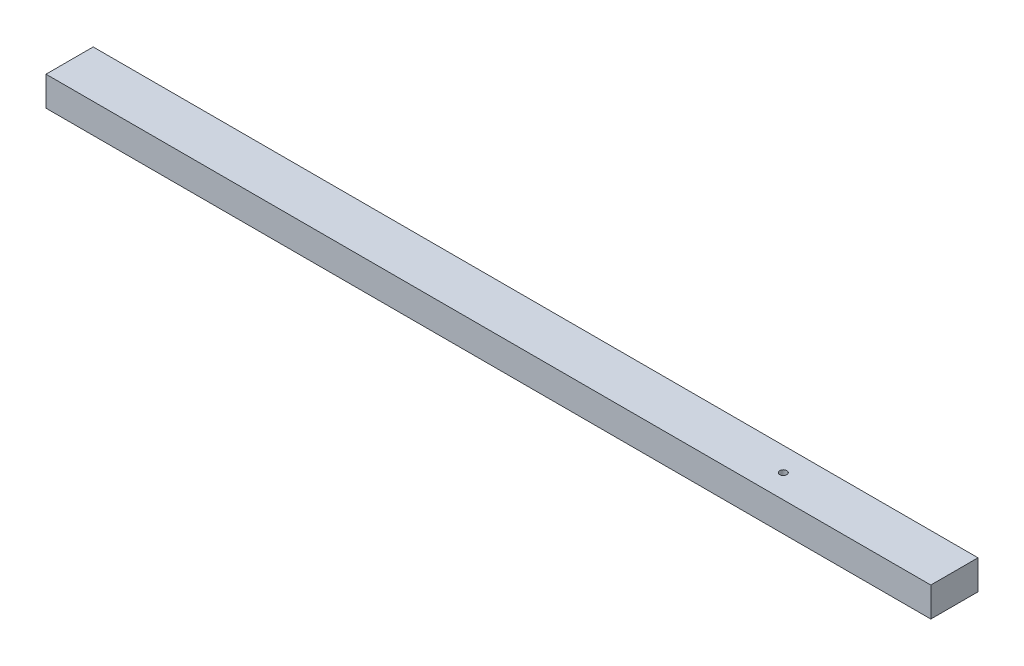
ISO-10303-21;
HEADER;
FILE_DESCRIPTION(('STEP AP214'),'2;1');
FILE_NAME('part.step','',(''),(''),'','','');
FILE_SCHEMA(('AUTOMOTIVE_DESIGN { 1 0 10303 214 1 1 1 1 }'));
ENDSEC;
DATA;
#1=APPLICATION_CONTEXT('core data for automotive mechanical design processes');
#2=APPLICATION_PROTOCOL_DEFINITION('international standard','automotive_design',2000,#1);
#3=PRODUCT_CONTEXT('',#1,'mechanical');
#4=PRODUCT('Part','Part','',(#3));
#5=PRODUCT_RELATED_PRODUCT_CATEGORY('part','',(#4));
#6=PRODUCT_DEFINITION_FORMATION('','',#4);
#7=PRODUCT_DEFINITION_CONTEXT('part definition',#1,'design');
#8=PRODUCT_DEFINITION('design','',#6,#7);
#9=PRODUCT_DEFINITION_SHAPE('','',#8);
#10=(LENGTH_UNIT() NAMED_UNIT(*) SI_UNIT(.MILLI.,.METRE.));
#11=(NAMED_UNIT(*) PLANE_ANGLE_UNIT() SI_UNIT($,.RADIAN.));
#12=(NAMED_UNIT(*) SI_UNIT($,.STERADIAN.) SOLID_ANGLE_UNIT());
#13=UNCERTAINTY_MEASURE_WITH_UNIT(LENGTH_MEASURE(1.E-05),#10,'distance_accuracy_value','');
#14=(GEOMETRIC_REPRESENTATION_CONTEXT(3) GLOBAL_UNCERTAINTY_ASSIGNED_CONTEXT((#13)) GLOBAL_UNIT_ASSIGNED_CONTEXT((#10,
#11,#12)) REPRESENTATION_CONTEXT('',''));
#15=CARTESIAN_POINT('',(0.,0.,0.));
#16=DIRECTION('',(0.,0.,1.));
#17=DIRECTION('',(1.,0.,0.));
#18=AXIS2_PLACEMENT_3D('',#15,#16,#17);
#19=CARTESIAN_POINT('',(1500.,0.,0.));
#20=DIRECTION('',(0.,0.,-1.));
#21=DIRECTION('',(-1.,0.,0.));
#22=AXIS2_PLACEMENT_3D('',#19,#20,#21);
#23=PLANE('',#22);
#24=DIRECTION('',(0.,-1.,0.));
#25=VECTOR('',#24,1.);
#26=CARTESIAN_POINT('',(0.,0.,0.));
#27=LINE('',#26,#25);
#28=CARTESIAN_POINT('',(0.,50.,0.));
#29=VERTEX_POINT('',#28);
#30=CARTESIAN_POINT('',(0.,0.,0.));
#31=VERTEX_POINT('',#30);
#32=EDGE_CURVE('E100',#29,#31,#27,.T.);
#33=ORIENTED_EDGE('',*,*,#32,.T.);
#34=DIRECTION('',(-1.,0.,0.));
#35=VECTOR('',#34,1.);
#36=CARTESIAN_POINT('',(1500.,0.,0.));
#37=LINE('',#36,#35);
#38=CARTESIAN_POINT('',(1500.,0.,0.));
#39=VERTEX_POINT('',#38);
#40=EDGE_CURVE('E11',#39,#31,#37,.T.);
#41=ORIENTED_EDGE('',*,*,#40,.F.);
#42=DIRECTION('',(0.,-1.,0.));
#43=VECTOR('',#42,1.);
#44=CARTESIAN_POINT('',(1500.,0.,0.));
#45=LINE('',#44,#43);
#46=CARTESIAN_POINT('',(1500.,50.,0.));
#47=VERTEX_POINT('',#46);
#48=EDGE_CURVE('E88',#47,#39,#45,.T.);
#49=ORIENTED_EDGE('',*,*,#48,.F.);
#50=DIRECTION('',(-1.,0.,0.));
#51=VECTOR('',#50,1.);
#52=CARTESIAN_POINT('',(1500.,50.,0.));
#53=LINE('',#52,#51);
#54=EDGE_CURVE('E96',#47,#29,#53,.T.);
#55=ORIENTED_EDGE('',*,*,#54,.T.);
#56=EDGE_LOOP('',(#33,#41,#49,#55));
#57=FACE_BOUND('',#56,.T.);
#58=ADVANCED_FACE('F37',(#57),#23,.F.);
#59=CARTESIAN_POINT('',(1500.,0.,0.));
#60=DIRECTION('',(0.,1.,0.));
#61=DIRECTION('',(0.,0.,1.));
#62=AXIS2_PLACEMENT_3D('',#59,#60,#61);
#63=PLANE('',#62);
#64=CARTESIAN_POINT('',(1210.,0.,-40.0000000000002));
#65=DIRECTION('',(0.,1.,0.));
#66=DIRECTION('',(0.,0.,1.));
#67=AXIS2_PLACEMENT_3D('',#64,#65,#66);
#68=CIRCLE('',#67,6.0000000000001);
#69=CARTESIAN_POINT('',(1210.,0.,-34.0000000000001));
#70=VERTEX_POINT('',#69);
#71=EDGE_CURVE('E103',#70,#70,#68,.T.);
#72=ORIENTED_EDGE('',*,*,#71,.T.);
#73=EDGE_LOOP('',(#72));
#74=FACE_BOUND('',#73,.T.);
#75=DIRECTION('',(0.,0.,-1.));
#76=VECTOR('',#75,1.);
#77=CARTESIAN_POINT('',(0.,0.,0.));
#78=LINE('',#77,#76);
#79=CARTESIAN_POINT('',(0.,0.,-80.));
#80=VERTEX_POINT('',#79);
#81=EDGE_CURVE('E92',#31,#80,#78,.T.);
#82=ORIENTED_EDGE('',*,*,#81,.T.);
#83=DIRECTION('',(-1.,0.,0.));
#84=VECTOR('',#83,1.);
#85=CARTESIAN_POINT('',(1500.,0.,-80.));
#86=LINE('',#85,#84);
#87=CARTESIAN_POINT('',(1500.,0.,-80.));
#88=VERTEX_POINT('',#87);
#89=EDGE_CURVE('E45',#88,#80,#86,.T.);
#90=ORIENTED_EDGE('',*,*,#89,.F.);
#91=DIRECTION('',(0.,0.,-1.));
#92=VECTOR('',#91,1.);
#93=CARTESIAN_POINT('',(1500.,0.,0.));
#94=LINE('',#93,#92);
#95=EDGE_CURVE('E83',#39,#88,#94,.T.);
#96=ORIENTED_EDGE('',*,*,#95,.F.);
#97=ORIENTED_EDGE('',*,*,#40,.T.);
#98=EDGE_LOOP('',(#82,#90,#96,#97));
#99=FACE_BOUND('',#98,.T.);
#100=ADVANCED_FACE('F91',(#74,#99),#63,.F.);
#101=CARTESIAN_POINT('',(1500.,0.,-80.));
#102=DIRECTION('',(0.,0.,1.));
#103=DIRECTION('',(1.,0.,0.));
#104=AXIS2_PLACEMENT_3D('',#101,#102,#103);
#105=PLANE('',#104);
#106=DIRECTION('',(0.,1.,0.));
#107=VECTOR('',#106,1.);
#108=CARTESIAN_POINT('',(0.,0.,-80.));
#109=LINE('',#108,#107);
#110=CARTESIAN_POINT('',(0.,50.,-80.));
#111=VERTEX_POINT('',#110);
#112=EDGE_CURVE('E70',#80,#111,#109,.T.);
#113=ORIENTED_EDGE('',*,*,#112,.T.);
#114=DIRECTION('',(-1.,0.,0.));
#115=VECTOR('',#114,1.);
#116=CARTESIAN_POINT('',(1500.,50.,-80.));
#117=LINE('',#116,#115);
#118=CARTESIAN_POINT('',(1500.,50.,-80.));
#119=VERTEX_POINT('',#118);
#120=EDGE_CURVE('E93',#119,#111,#117,.T.);
#121=ORIENTED_EDGE('',*,*,#120,.F.);
#122=DIRECTION('',(0.,1.,0.));
#123=VECTOR('',#122,1.);
#124=CARTESIAN_POINT('',(1500.,0.,-80.));
#125=LINE('',#124,#123);
#126=EDGE_CURVE('E86',#88,#119,#125,.T.);
#127=ORIENTED_EDGE('',*,*,#126,.F.);
#128=ORIENTED_EDGE('',*,*,#89,.T.);
#129=EDGE_LOOP('',(#113,#121,#127,#128));
#130=FACE_BOUND('',#129,.T.);
#131=ADVANCED_FACE('F94',(#130),#105,.F.);
#132=CARTESIAN_POINT('',(1500.,50.,0.));
#133=DIRECTION('',(0.,-1.,0.));
#134=DIRECTION('',(0.,0.,-1.));
#135=AXIS2_PLACEMENT_3D('',#132,#133,#134);
#136=PLANE('',#135);
#137=CARTESIAN_POINT('',(1210.,50.,-40.0000000000002));
#138=DIRECTION('',(0.,1.,0.));
#139=DIRECTION('',(0.,0.,1.));
#140=AXIS2_PLACEMENT_3D('',#137,#138,#139);
#141=CIRCLE('',#140,6.0000000000001);
#142=CARTESIAN_POINT('',(1210.,50.,-34.0000000000001));
#143=VERTEX_POINT('',#142);
#144=EDGE_CURVE('E114',#143,#143,#141,.T.);
#145=ORIENTED_EDGE('',*,*,#144,.F.);
#146=EDGE_LOOP('',(#145));
#147=FACE_BOUND('',#146,.T.);
#148=DIRECTION('',(0.,0.,1.));
#149=VECTOR('',#148,1.);
#150=CARTESIAN_POINT('',(0.,50.,0.));
#151=LINE('',#150,#149);
#152=EDGE_CURVE('E76',#111,#29,#151,.T.);
#153=ORIENTED_EDGE('',*,*,#152,.T.);
#154=ORIENTED_EDGE('',*,*,#54,.F.);
#155=DIRECTION('',(0.,0.,1.));
#156=VECTOR('',#155,1.);
#157=CARTESIAN_POINT('',(1500.,50.,0.));
#158=LINE('',#157,#156);
#159=EDGE_CURVE('E53',#119,#47,#158,.T.);
#160=ORIENTED_EDGE('',*,*,#159,.F.);
#161=ORIENTED_EDGE('',*,*,#120,.T.);
#162=EDGE_LOOP('',(#153,#154,#160,#161));
#163=FACE_BOUND('',#162,.T.);
#164=ADVANCED_FACE('F108',(#147,#163),#136,.F.);
#165=CARTESIAN_POINT('',(1500.,0.,0.));
#166=DIRECTION('',(-1.,0.,0.));
#167=DIRECTION('',(0.,0.,1.));
#168=AXIS2_PLACEMENT_3D('',#165,#166,#167);
#169=PLANE('',#168);
#170=ORIENTED_EDGE('',*,*,#48,.T.);
#171=ORIENTED_EDGE('',*,*,#95,.T.);
#172=ORIENTED_EDGE('',*,*,#126,.T.);
#173=ORIENTED_EDGE('',*,*,#159,.T.);
#174=EDGE_LOOP('',(#170,#171,#172,#173));
#175=FACE_BOUND('',#174,.T.);
#176=ADVANCED_FACE('F84',(#175),#169,.F.);
#177=CARTESIAN_POINT('',(0.,0.,0.));
#178=DIRECTION('',(-1.,0.,0.));
#179=DIRECTION('',(0.,0.,1.));
#180=AXIS2_PLACEMENT_3D('',#177,#178,#179);
#181=PLANE('',#180);
#182=ORIENTED_EDGE('',*,*,#32,.F.);
#183=ORIENTED_EDGE('',*,*,#152,.F.);
#184=ORIENTED_EDGE('',*,*,#112,.F.);
#185=ORIENTED_EDGE('',*,*,#81,.F.);
#186=EDGE_LOOP('',(#182,#183,#184,#185));
#187=FACE_BOUND('',#186,.T.);
#188=ADVANCED_FACE('F111',(#187),#181,.T.);
#189=CARTESIAN_POINT('',(1210.,0.,-40.0000000000002));
#190=DIRECTION('',(0.,1.,0.));
#191=DIRECTION('',(0.,0.,1.));
#192=AXIS2_PLACEMENT_3D('',#189,#190,#191);
#193=CYLINDRICAL_SURFACE('',#192,6.0000000000001);
#194=ORIENTED_EDGE('',*,*,#71,.F.);
#195=EDGE_LOOP('',(#194));
#196=FACE_BOUND('',#195,.T.);
#197=ORIENTED_EDGE('',*,*,#144,.T.);
#198=EDGE_LOOP('',(#197));
#199=FACE_BOUND('',#198,.T.);
#200=ADVANCED_FACE('F121',(#196,#199),#193,.F.);
#201=CLOSED_SHELL('',(#58,#100,#131,#164,#176,#188,#200));
#202=MANIFOLD_SOLID_BREP('B2',#201);
#203=ADVANCED_BREP_SHAPE_REPRESENTATION('',(#18,#202),#14);
#204=SHAPE_DEFINITION_REPRESENTATION(#9,#203);
ENDSEC;
END-ISO-10303-21;
